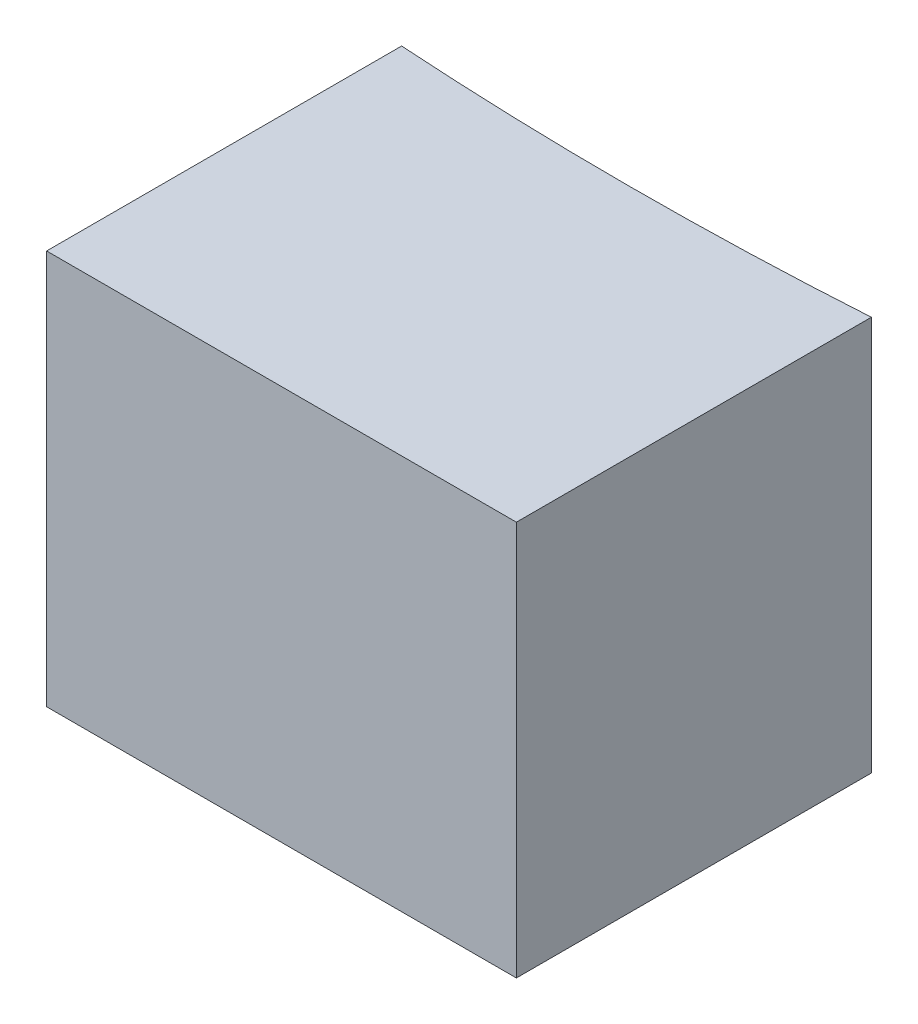
ISO-10303-21;
HEADER;
FILE_DESCRIPTION(('STEP AP214'),'2;1');
FILE_NAME('part.step','',(''),(''),'','','');
FILE_SCHEMA(('AUTOMOTIVE_DESIGN { 1 0 10303 214 1 1 1 1 }'));
ENDSEC;
DATA;
#1=APPLICATION_CONTEXT('core data for automotive mechanical design processes');
#2=APPLICATION_PROTOCOL_DEFINITION('international standard','automotive_design',2000,#1);
#3=PRODUCT_CONTEXT('',#1,'mechanical');
#4=PRODUCT('Part','Part','',(#3));
#5=PRODUCT_RELATED_PRODUCT_CATEGORY('part','',(#4));
#6=PRODUCT_DEFINITION_FORMATION('','',#4);
#7=PRODUCT_DEFINITION_CONTEXT('part definition',#1,'design');
#8=PRODUCT_DEFINITION('design','',#6,#7);
#9=PRODUCT_DEFINITION_SHAPE('','',#8);
#10=(LENGTH_UNIT() NAMED_UNIT(*) SI_UNIT(.MILLI.,.METRE.));
#11=(NAMED_UNIT(*) PLANE_ANGLE_UNIT() SI_UNIT($,.RADIAN.));
#12=(NAMED_UNIT(*) SI_UNIT($,.STERADIAN.) SOLID_ANGLE_UNIT());
#13=UNCERTAINTY_MEASURE_WITH_UNIT(LENGTH_MEASURE(1.E-05),#10,'distance_accuracy_value','');
#14=(GEOMETRIC_REPRESENTATION_CONTEXT(3) GLOBAL_UNCERTAINTY_ASSIGNED_CONTEXT((#13)) GLOBAL_UNIT_ASSIGNED_CONTEXT((#10,
#11,#12)) REPRESENTATION_CONTEXT('',''));
#15=CARTESIAN_POINT('',(0.,0.,0.));
#16=DIRECTION('',(0.,0.,1.));
#17=DIRECTION('',(1.,0.,0.));
#18=AXIS2_PLACEMENT_3D('',#15,#16,#17);
#19=CARTESIAN_POINT('',(2.58473797920544E-13,25.4,-6.57807142090405E-12));
#20=DIRECTION('',(0.,-1.,0.));
#21=DIRECTION('',(0.,0.,-1.));
#22=AXIS2_PLACEMENT_3D('',#19,#20,#21);
#23=CYLINDRICAL_SURFACE('',#22,233.553000000008);
#24=CARTESIAN_POINT('',(2.58473797920544E-13,0.,-6.57807142090405E-12));
#25=DIRECTION('',(0.,-1.,0.));
#26=DIRECTION('',(0.,0.,-1.));
#27=AXIS2_PLACEMENT_3D('',#24,#25,#26);
#28=CIRCLE('',#27,233.553000000008);
#29=CARTESIAN_POINT('',(15.113,0.,233.063512888656));
#30=VERTEX_POINT('',#29);
#31=CARTESIAN_POINT('',(-15.113,0.,233.063512888656));
#32=VERTEX_POINT('',#31);
#33=EDGE_CURVE('E98',#30,#32,#28,.T.);
#34=ORIENTED_EDGE('',*,*,#33,.T.);
#35=DIRECTION('',(0.,-1.,0.));
#36=VECTOR('',#35,1.);
#37=CARTESIAN_POINT('',(-15.113,25.4,233.063512888656));
#38=LINE('',#37,#36);
#39=CARTESIAN_POINT('',(-15.113,25.4,233.063512888656));
#40=VERTEX_POINT('',#39);
#41=EDGE_CURVE('E11',#40,#32,#38,.T.);
#42=ORIENTED_EDGE('',*,*,#41,.F.);
#43=CARTESIAN_POINT('',(2.58473797920544E-13,25.4,-6.57807142090405E-12));
#44=DIRECTION('',(0.,-1.,0.));
#45=DIRECTION('',(0.,0.,-1.));
#46=AXIS2_PLACEMENT_3D('',#43,#44,#45);
#47=CIRCLE('',#46,233.553000000008);
#48=CARTESIAN_POINT('',(15.113,25.4,233.063512888656));
#49=VERTEX_POINT('',#48);
#50=EDGE_CURVE('E86',#49,#40,#47,.T.);
#51=ORIENTED_EDGE('',*,*,#50,.F.);
#52=DIRECTION('',(0.,-1.,0.));
#53=VECTOR('',#52,1.);
#54=CARTESIAN_POINT('',(15.113,25.4,233.063512888656));
#55=LINE('',#54,#53);
#56=EDGE_CURVE('E94',#49,#30,#55,.T.);
#57=ORIENTED_EDGE('',*,*,#56,.T.);
#58=EDGE_LOOP('',(#34,#42,#51,#57));
#59=FACE_BOUND('',#58,.T.);
#60=ADVANCED_FACE('F35',(#59),#23,.F.);
#61=CARTESIAN_POINT('',(-15.113,25.4,255.905000000001));
#62=DIRECTION('',(1.,0.,0.));
#63=DIRECTION('',(0.,0.,-1.));
#64=AXIS2_PLACEMENT_3D('',#61,#62,#63);
#65=PLANE('',#64);
#66=DIRECTION('',(0.,0.,1.));
#67=VECTOR('',#66,1.);
#68=CARTESIAN_POINT('',(-15.113,0.,255.905000000001));
#69=LINE('',#68,#67);
#70=CARTESIAN_POINT('',(-15.113,0.,255.905000000001));
#71=VERTEX_POINT('',#70);
#72=EDGE_CURVE('E90',#32,#71,#69,.T.);
#73=ORIENTED_EDGE('',*,*,#72,.T.);
#74=DIRECTION('',(0.,-1.,0.));
#75=VECTOR('',#74,1.);
#76=CARTESIAN_POINT('',(-15.113,25.4,255.905000000001));
#77=LINE('',#76,#75);
#78=CARTESIAN_POINT('',(-15.113,25.4,255.905000000001));
#79=VERTEX_POINT('',#78);
#80=EDGE_CURVE('E43',#79,#71,#77,.T.);
#81=ORIENTED_EDGE('',*,*,#80,.F.);
#82=DIRECTION('',(0.,0.,1.));
#83=VECTOR('',#82,1.);
#84=CARTESIAN_POINT('',(-15.113,25.4,255.905000000001));
#85=LINE('',#84,#83);
#86=EDGE_CURVE('E81',#40,#79,#85,.T.);
#87=ORIENTED_EDGE('',*,*,#86,.F.);
#88=ORIENTED_EDGE('',*,*,#41,.T.);
#89=EDGE_LOOP('',(#73,#81,#87,#88));
#90=FACE_BOUND('',#89,.T.);
#91=ADVANCED_FACE('F89',(#90),#65,.F.);
#92=CARTESIAN_POINT('',(15.113,25.4,255.905000000001));
#93=DIRECTION('',(0.,0.,-1.));
#94=DIRECTION('',(-1.,0.,0.));
#95=AXIS2_PLACEMENT_3D('',#92,#93,#94);
#96=PLANE('',#95);
#97=DIRECTION('',(1.,0.,0.));
#98=VECTOR('',#97,1.);
#99=CARTESIAN_POINT('',(15.113,0.,255.905000000001));
#100=LINE('',#99,#98);
#101=CARTESIAN_POINT('',(15.113,0.,255.905000000001));
#102=VERTEX_POINT('',#101);
#103=EDGE_CURVE('E68',#71,#102,#100,.T.);
#104=ORIENTED_EDGE('',*,*,#103,.T.);
#105=DIRECTION('',(0.,-1.,0.));
#106=VECTOR('',#105,1.);
#107=CARTESIAN_POINT('',(15.113,25.4,255.905000000001));
#108=LINE('',#107,#106);
#109=CARTESIAN_POINT('',(15.113,25.4,255.905000000001));
#110=VERTEX_POINT('',#109);
#111=EDGE_CURVE('E91',#110,#102,#108,.T.);
#112=ORIENTED_EDGE('',*,*,#111,.F.);
#113=DIRECTION('',(1.,0.,0.));
#114=VECTOR('',#113,1.);
#115=CARTESIAN_POINT('',(15.113,25.4,255.905000000001));
#116=LINE('',#115,#114);
#117=EDGE_CURVE('E84',#79,#110,#116,.T.);
#118=ORIENTED_EDGE('',*,*,#117,.F.);
#119=ORIENTED_EDGE('',*,*,#80,.T.);
#120=EDGE_LOOP('',(#104,#112,#118,#119));
#121=FACE_BOUND('',#120,.T.);
#122=ADVANCED_FACE('F92',(#121),#96,.F.);
#123=CARTESIAN_POINT('',(15.113,25.4,233.063512888656));
#124=DIRECTION('',(-1.,0.,0.));
#125=DIRECTION('',(0.,0.,1.));
#126=AXIS2_PLACEMENT_3D('',#123,#124,#125);
#127=PLANE('',#126);
#128=DIRECTION('',(0.,0.,-1.));
#129=VECTOR('',#128,1.);
#130=CARTESIAN_POINT('',(15.113,0.,233.063512888656));
#131=LINE('',#130,#129);
#132=EDGE_CURVE('E74',#102,#30,#131,.T.);
#133=ORIENTED_EDGE('',*,*,#132,.T.);
#134=ORIENTED_EDGE('',*,*,#56,.F.);
#135=DIRECTION('',(0.,0.,-1.));
#136=VECTOR('',#135,1.);
#137=CARTESIAN_POINT('',(15.113,25.4,233.063512888656));
#138=LINE('',#137,#136);
#139=EDGE_CURVE('E51',#110,#49,#138,.T.);
#140=ORIENTED_EDGE('',*,*,#139,.F.);
#141=ORIENTED_EDGE('',*,*,#111,.T.);
#142=EDGE_LOOP('',(#133,#134,#140,#141));
#143=FACE_BOUND('',#142,.T.);
#144=ADVANCED_FACE('F105',(#143),#127,.F.);
#145=CARTESIAN_POINT('',(2.58473797920544E-13,25.4,-6.57807142090405E-12));
#146=DIRECTION('',(0.,-1.,0.));
#147=DIRECTION('',(0.,0.,-1.));
#148=AXIS2_PLACEMENT_3D('',#145,#146,#147);
#149=PLANE('',#148);
#150=ORIENTED_EDGE('',*,*,#50,.T.);
#151=ORIENTED_EDGE('',*,*,#86,.T.);
#152=ORIENTED_EDGE('',*,*,#117,.T.);
#153=ORIENTED_EDGE('',*,*,#139,.T.);
#154=EDGE_LOOP('',(#150,#151,#152,#153));
#155=FACE_BOUND('',#154,.T.);
#156=ADVANCED_FACE('F82',(#155),#149,.F.);
#157=CARTESIAN_POINT('',(2.58473797920544E-13,0.,-6.57807142090405E-12));
#158=DIRECTION('',(0.,-1.,0.));
#159=DIRECTION('',(0.,0.,-1.));
#160=AXIS2_PLACEMENT_3D('',#157,#158,#159);
#161=PLANE('',#160);
#162=ORIENTED_EDGE('',*,*,#33,.F.);
#163=ORIENTED_EDGE('',*,*,#132,.F.);
#164=ORIENTED_EDGE('',*,*,#103,.F.);
#165=ORIENTED_EDGE('',*,*,#72,.F.);
#166=EDGE_LOOP('',(#162,#163,#164,#165));
#167=FACE_BOUND('',#166,.T.);
#168=ADVANCED_FACE('F108',(#167),#161,.T.);
#169=CLOSED_SHELL('',(#60,#91,#122,#144,#156,#168));
#170=MANIFOLD_SOLID_BREP('B2',#169);
#171=ADVANCED_BREP_SHAPE_REPRESENTATION('',(#18,#170),#14);
#172=SHAPE_DEFINITION_REPRESENTATION(#9,#171);
ENDSEC;
END-ISO-10303-21;
